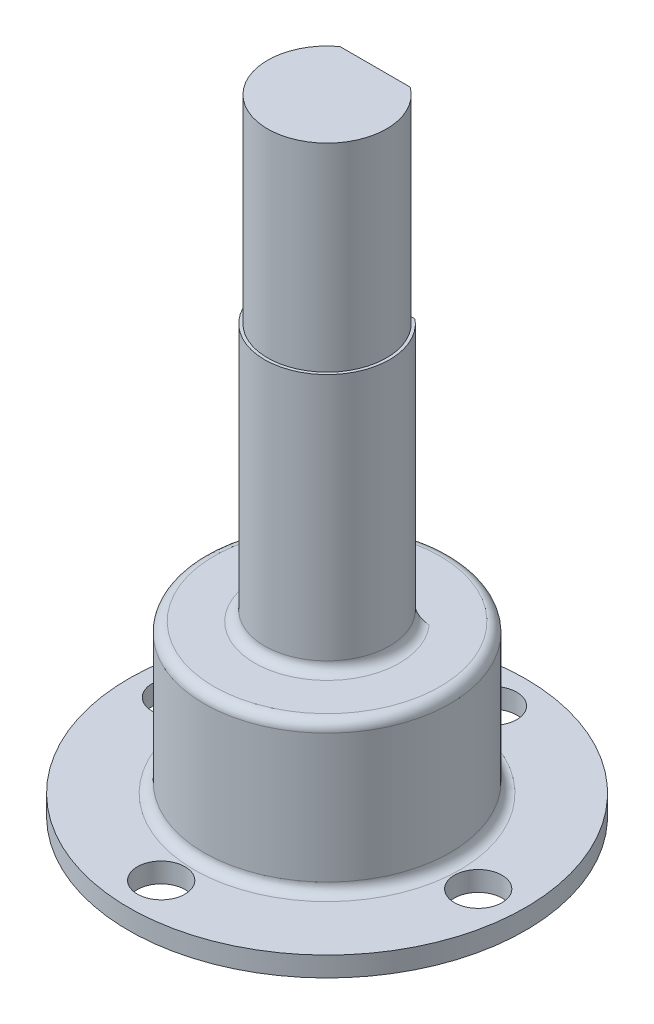
ISO-10303-21;
HEADER;
FILE_DESCRIPTION(('STEP AP214'),'2;1');
FILE_NAME('part.step','',(''),(''),'','','');
FILE_SCHEMA(('AUTOMOTIVE_DESIGN { 1 0 10303 214 1 1 1 1 }'));
ENDSEC;
DATA;
#1=APPLICATION_CONTEXT('core data for automotive mechanical design processes');
#2=APPLICATION_PROTOCOL_DEFINITION('international standard','automotive_design',2000,#1);
#3=PRODUCT_CONTEXT('',#1,'mechanical');
#4=PRODUCT('Part','Part','',(#3));
#5=PRODUCT_RELATED_PRODUCT_CATEGORY('part','',(#4));
#6=PRODUCT_DEFINITION_FORMATION('','',#4);
#7=PRODUCT_DEFINITION_CONTEXT('part definition',#1,'design');
#8=PRODUCT_DEFINITION('design','',#6,#7);
#9=PRODUCT_DEFINITION_SHAPE('','',#8);
#10=(LENGTH_UNIT() NAMED_UNIT(*) SI_UNIT(.MILLI.,.METRE.));
#11=(NAMED_UNIT(*) PLANE_ANGLE_UNIT() SI_UNIT($,.RADIAN.));
#12=(NAMED_UNIT(*) SI_UNIT($,.STERADIAN.) SOLID_ANGLE_UNIT());
#13=UNCERTAINTY_MEASURE_WITH_UNIT(LENGTH_MEASURE(1.E-05),#10,'distance_accuracy_value','');
#14=(GEOMETRIC_REPRESENTATION_CONTEXT(3) GLOBAL_UNCERTAINTY_ASSIGNED_CONTEXT((#13)) GLOBAL_UNIT_ASSIGNED_CONTEXT((#10,
#11,#12)) REPRESENTATION_CONTEXT('',''));
#15=CARTESIAN_POINT('',(0.,0.,0.));
#16=DIRECTION('',(0.,0.,1.));
#17=DIRECTION('',(1.,0.,0.));
#18=AXIS2_PLACEMENT_3D('',#15,#16,#17);
#19=CARTESIAN_POINT('',(0.,31.5,0.));
#20=DIRECTION('',(0.,1.,0.));
#21=DIRECTION('',(0.,0.,1.));
#22=AXIS2_PLACEMENT_3D('',#19,#20,#21);
#23=PLANE('',#22);
#24=DIRECTION('',(1.,0.,0.));
#25=VECTOR('',#24,1.);
#26=CARTESIAN_POINT('',(-3.64134224162171,31.5,-2.42190413345966));
#27=LINE('',#26,#25);
#28=CARTESIAN_POINT('',(-1.7704181337557,31.5,-2.42190413345966));
#29=VERTEX_POINT('',#28);
#30=CARTESIAN_POINT('',(1.7704181337557,31.5,-2.42190413345966));
#31=VERTEX_POINT('',#30);
#32=EDGE_CURVE('E94',#29,#31,#27,.T.);
#33=ORIENTED_EDGE('',*,*,#32,.F.);
#34=CARTESIAN_POINT('',(0.,31.5,0.));
#35=DIRECTION('',(0.,-1.,0.));
#36=DIRECTION('',(0.,0.,-1.));
#37=AXIS2_PLACEMENT_3D('',#34,#35,#36);
#38=CIRCLE('',#37,3.);
#39=EDGE_CURVE('E107',#31,#29,#38,.T.);
#40=ORIENTED_EDGE('',*,*,#39,.F.);
#41=EDGE_LOOP('',(#33,#40));
#42=FACE_BOUND('',#41,.T.);
#43=ADVANCED_FACE('F39',(#42),#23,.T.);
#44=CARTESIAN_POINT('',(0.,5.,0.));
#45=DIRECTION('',(0.,-1.,0.));
#46=DIRECTION('',(0.,0.,-1.));
#47=AXIS2_PLACEMENT_3D('',#44,#45,#46);
#48=CYLINDRICAL_SURFACE('',#47,3.);
#49=DIRECTION('',(0.,-1.,0.));
#50=VECTOR('',#49,1.);
#51=CARTESIAN_POINT('',(-1.7704181337557,5.,-2.42190413345966));
#52=LINE('',#51,#50);
#53=CARTESIAN_POINT('',(-1.77041813375571,21.5,-2.42190413345966));
#54=VERTEX_POINT('',#53);
#55=EDGE_CURVE('E91',#54,#29,#52,.F.);
#56=ORIENTED_EDGE('',*,*,#55,.F.);
#57=CARTESIAN_POINT('',(0.,21.5,0.));
#58=DIRECTION('',(0.,-1.,0.));
#59=DIRECTION('',(0.,0.,-1.));
#60=AXIS2_PLACEMENT_3D('',#57,#58,#59);
#61=CIRCLE('',#60,3.00000000000001);
#62=CARTESIAN_POINT('',(1.77041813375571,21.5,-2.42190413345966));
#63=VERTEX_POINT('',#62);
#64=EDGE_CURVE('E116',#63,#54,#61,.T.);
#65=ORIENTED_EDGE('',*,*,#64,.F.);
#66=DIRECTION('',(0.,-1.,0.));
#67=VECTOR('',#66,1.);
#68=CARTESIAN_POINT('',(1.7704181337557,5.,-2.42190413345966));
#69=LINE('',#68,#67);
#70=EDGE_CURVE('E113',#31,#63,#69,.T.);
#71=ORIENTED_EDGE('',*,*,#70,.F.);
#72=ORIENTED_EDGE('',*,*,#39,.T.);
#73=EDGE_LOOP('',(#56,#65,#71,#72));
#74=FACE_BOUND('',#73,.T.);
#75=ADVANCED_FACE('F112',(#74),#48,.T.);
#76=CARTESIAN_POINT('',(3.15,21.5,0.));
#77=DIRECTION('',(0.,1.,0.));
#78=DIRECTION('',(0.,0.,1.));
#79=AXIS2_PLACEMENT_3D('',#76,#77,#78);
#80=PLANE('',#79);
#81=DIRECTION('',(1.,0.,0.));
#82=VECTOR('',#81,1.);
#83=CARTESIAN_POINT('',(3.15,21.5,-2.42190413345966));
#84=LINE('',#83,#82);
#85=CARTESIAN_POINT('',(-2.01416989559744,21.5,-2.42190413345966));
#86=VERTEX_POINT('',#85);
#87=EDGE_CURVE('E97',#86,#54,#84,.T.);
#88=ORIENTED_EDGE('',*,*,#87,.F.);
#89=CARTESIAN_POINT('',(0.,21.5,0.));
#90=DIRECTION('',(0.,-1.,0.));
#91=DIRECTION('',(0.,0.,-1.));
#92=AXIS2_PLACEMENT_3D('',#89,#90,#91);
#93=CIRCLE('',#92,3.15);
#94=CARTESIAN_POINT('',(2.01416989559744,21.5,-2.42190413345966));
#95=VERTEX_POINT('',#94);
#96=EDGE_CURVE('E123',#95,#86,#93,.T.);
#97=ORIENTED_EDGE('',*,*,#96,.F.);
#98=EDGE_CURVE('E236',#63,#95,#84,.T.);
#99=ORIENTED_EDGE('',*,*,#98,.F.);
#100=ORIENTED_EDGE('',*,*,#64,.T.);
#101=EDGE_LOOP('',(#88,#97,#99,#100));
#102=FACE_BOUND('',#101,.T.);
#103=ADVANCED_FACE('F172',(#102),#80,.T.);
#104=CARTESIAN_POINT('',(0.,5.,0.));
#105=DIRECTION('',(0.,-1.,0.));
#106=DIRECTION('',(0.,0.,-1.));
#107=AXIS2_PLACEMENT_3D('',#104,#105,#106);
#108=CYLINDRICAL_SURFACE('',#107,3.15);
#109=DIRECTION('',(0.,-1.,0.));
#110=VECTOR('',#109,1.);
#111=CARTESIAN_POINT('',(-2.01416989559744,5.,-2.42190413345966));
#112=LINE('',#111,#110);
#113=CARTESIAN_POINT('',(-2.01416989559744,9.,-2.42190413345966));
#114=VERTEX_POINT('',#113);
#115=EDGE_CURVE('E233',#114,#86,#112,.F.);
#116=ORIENTED_EDGE('',*,*,#115,.F.);
#117=CARTESIAN_POINT('',(0.,9.,0.));
#118=DIRECTION('',(0.,1.,0.));
#119=DIRECTION('',(0.,0.,1.));
#120=AXIS2_PLACEMENT_3D('',#117,#118,#119);
#121=CIRCLE('',#120,3.15);
#122=CARTESIAN_POINT('',(2.01416989559744,9.,-2.42190413345966));
#123=VERTEX_POINT('',#122);
#124=EDGE_CURVE('E61',#114,#123,#121,.T.);
#125=ORIENTED_EDGE('',*,*,#124,.T.);
#126=DIRECTION('',(0.,-1.,0.));
#127=VECTOR('',#126,1.);
#128=CARTESIAN_POINT('',(2.01416989559744,5.,-2.42190413345966));
#129=LINE('',#128,#127);
#130=EDGE_CURVE('E234',#95,#123,#129,.T.);
#131=ORIENTED_EDGE('',*,*,#130,.F.);
#132=ORIENTED_EDGE('',*,*,#96,.T.);
#133=EDGE_LOOP('',(#116,#125,#131,#132));
#134=FACE_BOUND('',#133,.T.);
#135=ADVANCED_FACE('F176',(#134),#108,.T.);
#136=CARTESIAN_POINT('',(3.15,8.5,0.));
#137=DIRECTION('',(0.,1.,0.));
#138=DIRECTION('',(0.,0.,1.));
#139=AXIS2_PLACEMENT_3D('',#136,#137,#138);
#140=PLANE('',#139);
#141=CARTESIAN_POINT('',(0.,8.5,0.));
#142=DIRECTION('',(0.,1.,0.));
#143=DIRECTION('',(0.,0.,1.));
#144=AXIS2_PLACEMENT_3D('',#141,#142,#143);
#145=CIRCLE('',#144,5.7);
#146=CARTESIAN_POINT('',(0.,8.5,5.7));
#147=VERTEX_POINT('',#146);
#148=EDGE_CURVE('E115',#147,#147,#145,.T.);
#149=ORIENTED_EDGE('',*,*,#148,.T.);
#150=EDGE_LOOP('',(#149));
#151=FACE_BOUND('',#150,.T.);
#152=CARTESIAN_POINT('',(0.,8.5,0.));
#153=DIRECTION('',(0.,1.,0.));
#154=DIRECTION('',(0.,0.,1.));
#155=AXIS2_PLACEMENT_3D('',#152,#153,#154);
#156=CIRCLE('',#155,3.65);
#157=CARTESIAN_POINT('',(2.73072890787991,8.5,-2.42190413345966));
#158=VERTEX_POINT('',#157);
#159=CARTESIAN_POINT('',(-2.73072890787991,8.5,-2.42190413345966));
#160=VERTEX_POINT('',#159);
#161=EDGE_CURVE('E121',#158,#160,#156,.F.);
#162=ORIENTED_EDGE('',*,*,#161,.T.);
#163=DIRECTION('',(-1.,0.,0.));
#164=VECTOR('',#163,1.);
#165=CARTESIAN_POINT('',(-3.64134224162171,8.5,-2.42190413345966));
#166=LINE('',#165,#164);
#167=EDGE_CURVE('E109',#158,#160,#166,.T.);
#168=ORIENTED_EDGE('',*,*,#167,.F.);
#169=EDGE_LOOP('',(#162,#168));
#170=FACE_BOUND('',#169,.T.);
#171=ADVANCED_FACE('F182',(#151,#170),#140,.T.);
#172=CARTESIAN_POINT('',(0.,5.,0.));
#173=DIRECTION('',(0.,-1.,0.));
#174=DIRECTION('',(0.,0.,-1.));
#175=AXIS2_PLACEMENT_3D('',#172,#173,#174);
#176=CYLINDRICAL_SURFACE('',#175,6.2);
#177=CARTESIAN_POINT('',(0.,8.,0.));
#178=DIRECTION('',(0.,1.,0.));
#179=DIRECTION('',(0.,0.,1.));
#180=AXIS2_PLACEMENT_3D('',#177,#178,#179);
#181=CIRCLE('',#180,6.2);
#182=CARTESIAN_POINT('',(0.,8.,6.2));
#183=VERTEX_POINT('',#182);
#184=EDGE_CURVE('E136',#183,#183,#181,.F.);
#185=ORIENTED_EDGE('',*,*,#184,.T.);
#186=EDGE_LOOP('',(#185));
#187=FACE_BOUND('',#186,.T.);
#188=CARTESIAN_POINT('',(0.,1.5,0.));
#189=DIRECTION('',(0.,1.,0.));
#190=DIRECTION('',(0.,0.,1.));
#191=AXIS2_PLACEMENT_3D('',#188,#189,#190);
#192=CIRCLE('',#191,6.2);
#193=CARTESIAN_POINT('',(0.,1.5,6.2));
#194=VERTEX_POINT('',#193);
#195=EDGE_CURVE('E132',#194,#194,#192,.T.);
#196=ORIENTED_EDGE('',*,*,#195,.T.);
#197=EDGE_LOOP('',(#196));
#198=FACE_BOUND('',#197,.T.);
#199=ADVANCED_FACE('F185',(#187,#198),#176,.T.);
#200=CARTESIAN_POINT('',(6.2,1.,0.));
#201=DIRECTION('',(0.,1.,0.));
#202=DIRECTION('',(0.,0.,1.));
#203=AXIS2_PLACEMENT_3D('',#200,#201,#202);
#204=PLANE('',#203);
#205=CARTESIAN_POINT('',(0.,1.,0.));
#206=DIRECTION('',(0.,1.,0.));
#207=DIRECTION('',(0.,0.,1.));
#208=AXIS2_PLACEMENT_3D('',#205,#206,#207);
#209=CIRCLE('',#208,6.7);
#210=CARTESIAN_POINT('',(0.,1.,6.7));
#211=VERTEX_POINT('',#210);
#212=EDGE_CURVE('E140',#211,#211,#209,.F.);
#213=ORIENTED_EDGE('',*,*,#212,.T.);
#214=EDGE_LOOP('',(#213));
#215=FACE_BOUND('',#214,.T.);
#216=CARTESIAN_POINT('',(-7.99137872735473,1.,-0.371303159133185));
#217=DIRECTION('',(0.,1.,0.));
#218=DIRECTION('',(0.,0.,1.));
#219=AXIS2_PLACEMENT_3D('',#216,#217,#218);
#220=CIRCLE('',#219,1.2);
#221=CARTESIAN_POINT('',(-7.99137872735473,1.,0.828696840866815));
#222=VERTEX_POINT('',#221);
#223=EDGE_CURVE('E276',#222,#222,#220,.T.);
#224=ORIENTED_EDGE('',*,*,#223,.F.);
#225=EDGE_LOOP('',(#224));
#226=FACE_BOUND('',#225,.T.);
#227=CARTESIAN_POINT('',(-0.371303159133101,1.,7.99137872735473));
#228=DIRECTION('',(0.,1.,0.));
#229=DIRECTION('',(0.,0.,1.));
#230=AXIS2_PLACEMENT_3D('',#227,#228,#229);
#231=CIRCLE('',#230,1.2);
#232=CARTESIAN_POINT('',(-0.371303159133101,1.,9.19137872735473));
#233=VERTEX_POINT('',#232);
#234=EDGE_CURVE('E268',#233,#233,#231,.T.);
#235=ORIENTED_EDGE('',*,*,#234,.F.);
#236=EDGE_LOOP('',(#235));
#237=FACE_BOUND('',#236,.T.);
#238=CARTESIAN_POINT('',(7.99137872735473,1.,0.371303159133129));
#239=DIRECTION('',(0.,1.,0.));
#240=DIRECTION('',(0.,0.,1.));
#241=AXIS2_PLACEMENT_3D('',#238,#239,#240);
#242=CIRCLE('',#241,1.2);
#243=CARTESIAN_POINT('',(7.99137872735473,1.,1.57130315913313));
#244=VERTEX_POINT('',#243);
#245=EDGE_CURVE('E260',#244,#244,#242,.T.);
#246=ORIENTED_EDGE('',*,*,#245,.F.);
#247=EDGE_LOOP('',(#246));
#248=FACE_BOUND('',#247,.T.);
#249=CARTESIAN_POINT('',(0.371303159133101,1.,-7.99137872735473));
#250=DIRECTION('',(0.,1.,0.));
#251=DIRECTION('',(0.,0.,1.));
#252=AXIS2_PLACEMENT_3D('',#249,#250,#251);
#253=CIRCLE('',#252,1.2);
#254=CARTESIAN_POINT('',(0.371303159133101,1.,-6.79137872735473));
#255=VERTEX_POINT('',#254);
#256=EDGE_CURVE('E252',#255,#255,#253,.T.);
#257=ORIENTED_EDGE('',*,*,#256,.F.);
#258=EDGE_LOOP('',(#257));
#259=FACE_BOUND('',#258,.T.);
#260=CARTESIAN_POINT('',(0.,1.,0.));
#261=DIRECTION('',(0.,-1.,0.));
#262=DIRECTION('',(0.,0.,-1.));
#263=AXIS2_PLACEMENT_3D('',#260,#261,#262);
#264=CIRCLE('',#263,10.);
#265=CARTESIAN_POINT('',(0.,1.,-10.));
#266=VERTEX_POINT('',#265);
#267=EDGE_CURVE('E227',#266,#266,#264,.T.);
#268=ORIENTED_EDGE('',*,*,#267,.F.);
#269=EDGE_LOOP('',(#268));
#270=FACE_BOUND('',#269,.T.);
#271=ADVANCED_FACE('F189',(#215,#226,#237,#248,#259,#270),#204,.T.);
#272=CARTESIAN_POINT('',(0.,5.,0.));
#273=DIRECTION('',(0.,-1.,0.));
#274=DIRECTION('',(0.,0.,-1.));
#275=AXIS2_PLACEMENT_3D('',#272,#273,#274);
#276=CYLINDRICAL_SURFACE('',#275,10.);
#277=ORIENTED_EDGE('',*,*,#267,.T.);
#278=EDGE_LOOP('',(#277));
#279=FACE_BOUND('',#278,.T.);
#280=CARTESIAN_POINT('',(0.,0.,0.));
#281=DIRECTION('',(0.,-1.,0.));
#282=DIRECTION('',(0.,0.,-1.));
#283=AXIS2_PLACEMENT_3D('',#280,#281,#282);
#284=CIRCLE('',#283,10.);
#285=CARTESIAN_POINT('',(0.,0.,-10.));
#286=VERTEX_POINT('',#285);
#287=EDGE_CURVE('E220',#286,#286,#284,.T.);
#288=ORIENTED_EDGE('',*,*,#287,.F.);
#289=EDGE_LOOP('',(#288));
#290=FACE_BOUND('',#289,.T.);
#291=ADVANCED_FACE('F193',(#279,#290),#276,.T.);
#292=CARTESIAN_POINT('',(10.,0.,0.));
#293=DIRECTION('',(0.,-1.,0.));
#294=DIRECTION('',(0.,0.,-1.));
#295=AXIS2_PLACEMENT_3D('',#292,#293,#294);
#296=PLANE('',#295);
#297=CARTESIAN_POINT('',(-7.99137872735473,0.,-0.371303159133185));
#298=DIRECTION('',(0.,-1.,0.));
#299=DIRECTION('',(0.,0.,-1.));
#300=AXIS2_PLACEMENT_3D('',#297,#298,#299);
#301=CIRCLE('',#300,1.2);
#302=CARTESIAN_POINT('',(-7.99137872735473,0.,-1.57130315913318));
#303=VERTEX_POINT('',#302);
#304=EDGE_CURVE('E272',#303,#303,#301,.T.);
#305=ORIENTED_EDGE('',*,*,#304,.F.);
#306=EDGE_LOOP('',(#305));
#307=FACE_BOUND('',#306,.T.);
#308=CARTESIAN_POINT('',(-0.371303159133101,0.,7.99137872735473));
#309=DIRECTION('',(0.,-1.,0.));
#310=DIRECTION('',(0.,0.,-1.));
#311=AXIS2_PLACEMENT_3D('',#308,#309,#310);
#312=CIRCLE('',#311,1.2);
#313=CARTESIAN_POINT('',(-0.371303159133101,0.,6.79137872735473));
#314=VERTEX_POINT('',#313);
#315=EDGE_CURVE('E264',#314,#314,#312,.T.);
#316=ORIENTED_EDGE('',*,*,#315,.F.);
#317=EDGE_LOOP('',(#316));
#318=FACE_BOUND('',#317,.T.);
#319=CARTESIAN_POINT('',(7.99137872735473,0.,0.371303159133129));
#320=DIRECTION('',(0.,-1.,0.));
#321=DIRECTION('',(0.,0.,-1.));
#322=AXIS2_PLACEMENT_3D('',#319,#320,#321);
#323=CIRCLE('',#322,1.2);
#324=CARTESIAN_POINT('',(7.99137872735473,0.,-0.82869684086687));
#325=VERTEX_POINT('',#324);
#326=EDGE_CURVE('E256',#325,#325,#323,.T.);
#327=ORIENTED_EDGE('',*,*,#326,.F.);
#328=EDGE_LOOP('',(#327));
#329=FACE_BOUND('',#328,.T.);
#330=CARTESIAN_POINT('',(0.371303159133101,0.,-7.99137872735473));
#331=DIRECTION('',(0.,-1.,0.));
#332=DIRECTION('',(0.,0.,-1.));
#333=AXIS2_PLACEMENT_3D('',#330,#331,#332);
#334=CIRCLE('',#333,1.2);
#335=CARTESIAN_POINT('',(0.371303159133101,0.,-9.19137872735473));
#336=VERTEX_POINT('',#335);
#337=EDGE_CURVE('E110',#336,#336,#334,.T.);
#338=ORIENTED_EDGE('',*,*,#337,.F.);
#339=EDGE_LOOP('',(#338));
#340=FACE_BOUND('',#339,.T.);
#341=ORIENTED_EDGE('',*,*,#287,.T.);
#342=EDGE_LOOP('',(#341));
#343=FACE_BOUND('',#342,.T.);
#344=CARTESIAN_POINT('',(0.,0.,0.));
#345=DIRECTION('',(0.,-1.,0.));
#346=DIRECTION('',(0.,0.,-1.));
#347=AXIS2_PLACEMENT_3D('',#344,#345,#346);
#348=CIRCLE('',#347,4.5);
#349=CARTESIAN_POINT('',(0.,0.,-4.5));
#350=VERTEX_POINT('',#349);
#351=EDGE_CURVE('E216',#350,#350,#348,.T.);
#352=ORIENTED_EDGE('',*,*,#351,.F.);
#353=EDGE_LOOP('',(#352));
#354=FACE_BOUND('',#353,.T.);
#355=ADVANCED_FACE('F197',(#307,#318,#329,#340,#343,#354),#296,.T.);
#356=CARTESIAN_POINT('',(0.,5.,0.));
#357=DIRECTION('',(0.,-1.,0.));
#358=DIRECTION('',(0.,0.,-1.));
#359=AXIS2_PLACEMENT_3D('',#356,#357,#358);
#360=CYLINDRICAL_SURFACE('',#359,4.5);
#361=ORIENTED_EDGE('',*,*,#351,.T.);
#362=EDGE_LOOP('',(#361));
#363=FACE_BOUND('',#362,.T.);
#364=CARTESIAN_POINT('',(0.,5.,0.));
#365=DIRECTION('',(0.,-1.,0.));
#366=DIRECTION('',(0.,0.,-1.));
#367=AXIS2_PLACEMENT_3D('',#364,#365,#366);
#368=CIRCLE('',#367,4.5);
#369=CARTESIAN_POINT('',(0.,5.,-4.5));
#370=VERTEX_POINT('',#369);
#371=EDGE_CURVE('E103',#370,#370,#368,.T.);
#372=ORIENTED_EDGE('',*,*,#371,.F.);
#373=EDGE_LOOP('',(#372));
#374=FACE_BOUND('',#373,.T.);
#375=ADVANCED_FACE('F201',(#363,#374),#360,.F.);
#376=CARTESIAN_POINT('',(4.5,5.,0.));
#377=DIRECTION('',(0.,-1.,0.));
#378=DIRECTION('',(0.,0.,-1.));
#379=AXIS2_PLACEMENT_3D('',#376,#377,#378);
#380=PLANE('',#379);
#381=ORIENTED_EDGE('',*,*,#371,.T.);
#382=EDGE_LOOP('',(#381));
#383=FACE_BOUND('',#382,.T.);
#384=ADVANCED_FACE('F204',(#383),#380,.T.);
#385=CARTESIAN_POINT('',(-3.64134224162171,1.7776982286854,-2.42190413345966));
#386=DIRECTION('',(0.,0.,1.));
#387=DIRECTION('',(1.,0.,0.));
#388=AXIS2_PLACEMENT_3D('',#385,#386,#387);
#389=PLANE('',#388);
#390=ORIENTED_EDGE('',*,*,#55,.T.);
#391=ORIENTED_EDGE('',*,*,#32,.T.);
#392=ORIENTED_EDGE('',*,*,#70,.T.);
#393=ORIENTED_EDGE('',*,*,#98,.T.);
#394=ORIENTED_EDGE('',*,*,#130,.T.);
#395=CARTESIAN_POINT('',(2.01416989559744,9.,-2.42190413345966));
#396=CARTESIAN_POINT('',(2.01410251492904,8.97836536570635,-2.42190413345966));
#397=CARTESIAN_POINT('',(2.01636181038486,8.95681778662002,-2.42190413345966));
#398=CARTESIAN_POINT('',(2.02490984326628,8.91478724598333,-2.42190413345966));
#399=CARTESIAN_POINT('',(2.03115091115904,8.89429474849456,-2.42190413345966));
#400=CARTESIAN_POINT('',(2.04702757630945,8.85481779019472,-2.42190413345966));
#401=CARTESIAN_POINT('',(2.05664738323025,8.83582680943459,-2.42190413345966));
#402=CARTESIAN_POINT('',(2.07860147607339,8.79943433222572,-2.42190413345966));
#403=CARTESIAN_POINT('',(2.09094446794697,8.78203819283065,-2.42190413345966));
#404=CARTESIAN_POINT('',(2.12504561313686,8.73991431343108,-2.42190413345966));
#405=CARTESIAN_POINT('',(2.14826423824995,8.71637120283324,-2.42190413345966));
#406=CARTESIAN_POINT('',(2.19807954578482,8.67319553587424,-2.42190413345966));
#407=CARTESIAN_POINT('',(2.22468391532608,8.65357214798914,-2.42190413345966));
#408=CARTESIAN_POINT('',(2.29197143448726,8.61047003148581,-2.42190413345966));
#409=CARTESIAN_POINT('',(2.33385433334388,8.58886454486127,-2.42190413345966));
#410=CARTESIAN_POINT('',(2.42049947655846,8.55261526163959,-2.42190413345966));
#411=CARTESIAN_POINT('',(2.46526378422213,8.5379765181534,-2.42190413345966));
#412=CARTESIAN_POINT('',(2.54687820951526,8.5179366821242,-2.42190413345966));
#413=CARTESIAN_POINT('',(2.58341582475566,8.51124114471195,-2.42190413345966));
#414=CARTESIAN_POINT('',(2.65687358803554,8.50229131847252,-2.42190413345966));
#415=CARTESIAN_POINT('',(2.69379148020802,8.50001846459261,-2.42190413345966));
#416=CARTESIAN_POINT('',(2.73072890787991,8.5,-2.42190413345966));
#417=B_SPLINE_CURVE_WITH_KNOTS('',3,(#395,#396,#397,#398,#399,#400,#401,#402,#403,#404,#405,
#406,#407,#408,#409,#410,#411,#412,#413,#414,#415,#416),.UNSPECIFIED.,.F.,.F.,(4,2,2,2,2,2,2,2,
2,2,4),(0.,0.0646484168161605,0.128537030004227,0.192130951588462,0.255931205802625,
0.354575234680532,0.453447363614599,0.594086953761747,0.734828397587736,0.84600927384569,
0.956722431852321),.UNSPECIFIED.);
#418=EDGE_CURVE('E11',#123,#158,#417,.T.);
#419=ORIENTED_EDGE('',*,*,#418,.T.);
#420=ORIENTED_EDGE('',*,*,#167,.T.);
#421=CARTESIAN_POINT('',(-2.73072890787991,8.5,-2.42190413345966));
#422=CARTESIAN_POINT('',(-2.70488033474315,8.50000519389752,-2.42190413345966));
#423=CARTESIAN_POINT('',(-2.6790514739832,8.50112171072178,-2.42190413345966));
#424=CARTESIAN_POINT('',(-2.62757171281522,8.50552486168542,-2.42190413345966));
#425=CARTESIAN_POINT('',(-2.60192086293555,8.50881208841135,-2.42190413345966));
#426=CARTESIAN_POINT('',(-2.52512820183031,8.52190740454944,-2.42190413345966));
#427=CARTESIAN_POINT('',(-2.4744913089387,8.53494785050639,-2.42190413345966));
#428=CARTESIAN_POINT('',(-2.38492020987793,8.5664324779675,-2.42190413345966));
#429=CARTESIAN_POINT('',(-2.34549871738448,8.58351538972083,-2.42190413345966));
#430=CARTESIAN_POINT('',(-2.26985033077688,8.62363332665786,-2.42190413345966));
#431=CARTESIAN_POINT('',(-2.23361421500322,8.64665035678255,-2.42190413345966));
#432=CARTESIAN_POINT('',(-2.17793561238694,8.68992899005655,-2.42190413345966));
#433=CARTESIAN_POINT('',(-2.15705210107936,8.70833880323115,-2.42190413345966));
#434=CARTESIAN_POINT('',(-2.11819764091185,8.74804109043111,-2.42190413345966));
#435=CARTESIAN_POINT('',(-2.10022331697794,8.76933017066612,-2.42190413345966));
#436=CARTESIAN_POINT('',(-2.07200031980793,8.80958914418465,-2.42190413345966));
#437=CARTESIAN_POINT('',(-2.06092492494651,8.82797577028556,-2.42190413345966));
#438=CARTESIAN_POINT('',(-2.04190375158941,8.86627483571122,-2.42190413345966));
#439=CARTESIAN_POINT('',(-2.03394865525568,8.8861825168023,-2.42190413345966));
#440=CARTESIAN_POINT('',(-2.02342525080204,8.92174208920338,-2.42190413345966));
#441=CARTESIAN_POINT('',(-2.01999085895195,8.93713829679148,-2.42190413345966));
#442=CARTESIAN_POINT('',(-2.01534626515479,8.96834686585239,-2.42190413345966));
#443=CARTESIAN_POINT('',(-2.01414850529248,8.98416106187478,-2.42190413345966));
#444=CARTESIAN_POINT('',(-2.01416989559749,9.00000000000002,-2.42190413345966));
#445=B_SPLINE_CURVE_WITH_KNOTS('',3,(#421,#422,#423,#424,#425,#426,#427,#428,#429,#430,#431,
#432,#433,#434,#435,#436,#437,#438,#439,#440,#441,#442,#443,#444),.UNSPECIFIED.,.F.,.F.,(4,2,2,
2,2,2,2,2,2,2,2,4),(0.,0.0774850868345579,0.154991335232288,0.311026500897649,0.439501641903988,
0.567591676363427,0.650882788434769,0.734076567310733,0.798242047457127,0.862214430631374,
0.909383074076125,0.956813337588575),.UNSPECIFIED.);
#446=EDGE_CURVE('E54',#160,#114,#445,.T.);
#447=ORIENTED_EDGE('',*,*,#446,.T.);
#448=ORIENTED_EDGE('',*,*,#115,.T.);
#449=ORIENTED_EDGE('',*,*,#87,.T.);
#450=EDGE_LOOP('',(#390,#391,#392,#393,#394,#419,#420,#447,#448,#449));
#451=FACE_BOUND('',#450,.T.);
#452=ADVANCED_FACE('F93',(#451),#389,.F.);
#453=CARTESIAN_POINT('',(0.371303159133101,1.,-7.99137872735473));
#454=DIRECTION('',(0.,1.,0.));
#455=DIRECTION('',(0.,0.,1.));
#456=AXIS2_PLACEMENT_3D('',#453,#454,#455);
#457=CYLINDRICAL_SURFACE('',#456,1.2);
#458=ORIENTED_EDGE('',*,*,#256,.T.);
#459=EDGE_LOOP('',(#458));
#460=FACE_BOUND('',#459,.T.);
#461=ORIENTED_EDGE('',*,*,#337,.T.);
#462=EDGE_LOOP('',(#461));
#463=FACE_BOUND('',#462,.T.);
#464=ADVANCED_FACE('F211',(#460,#463),#457,.F.);
#465=CARTESIAN_POINT('',(7.99137872735473,1.,0.371303159133129));
#466=DIRECTION('',(0.,1.,0.));
#467=DIRECTION('',(0.,0.,1.));
#468=AXIS2_PLACEMENT_3D('',#465,#466,#467);
#469=CYLINDRICAL_SURFACE('',#468,1.2);
#470=ORIENTED_EDGE('',*,*,#245,.T.);
#471=EDGE_LOOP('',(#470));
#472=FACE_BOUND('',#471,.T.);
#473=ORIENTED_EDGE('',*,*,#326,.T.);
#474=EDGE_LOOP('',(#473));
#475=FACE_BOUND('',#474,.T.);
#476=ADVANCED_FACE('F299',(#472,#475),#469,.F.);
#477=CARTESIAN_POINT('',(-0.371303159133101,1.,7.99137872735473));
#478=DIRECTION('',(0.,1.,0.));
#479=DIRECTION('',(0.,0.,1.));
#480=AXIS2_PLACEMENT_3D('',#477,#478,#479);
#481=CYLINDRICAL_SURFACE('',#480,1.2);
#482=ORIENTED_EDGE('',*,*,#234,.T.);
#483=EDGE_LOOP('',(#482));
#484=FACE_BOUND('',#483,.T.);
#485=ORIENTED_EDGE('',*,*,#315,.T.);
#486=EDGE_LOOP('',(#485));
#487=FACE_BOUND('',#486,.T.);
#488=ADVANCED_FACE('F305',(#484,#487),#481,.F.);
#489=CARTESIAN_POINT('',(-7.99137872735473,1.,-0.371303159133185));
#490=DIRECTION('',(0.,1.,0.));
#491=DIRECTION('',(0.,0.,1.));
#492=AXIS2_PLACEMENT_3D('',#489,#490,#491);
#493=CYLINDRICAL_SURFACE('',#492,1.2);
#494=ORIENTED_EDGE('',*,*,#223,.T.);
#495=EDGE_LOOP('',(#494));
#496=FACE_BOUND('',#495,.T.);
#497=ORIENTED_EDGE('',*,*,#304,.T.);
#498=EDGE_LOOP('',(#497));
#499=FACE_BOUND('',#498,.T.);
#500=ADVANCED_FACE('F156',(#496,#499),#493,.F.);
#501=CARTESIAN_POINT('',(0.,9.,0.));
#502=DIRECTION('',(0.,1.,0.));
#503=DIRECTION('',(0.,0.,1.));
#504=AXIS2_PLACEMENT_3D('',#501,#502,#503);
#505=TOROIDAL_SURFACE('',#504,3.65,0.5);
#506=ORIENTED_EDGE('',*,*,#418,.F.);
#507=ORIENTED_EDGE('',*,*,#124,.F.);
#508=ORIENTED_EDGE('',*,*,#446,.F.);
#509=ORIENTED_EDGE('',*,*,#161,.F.);
#510=EDGE_LOOP('',(#506,#507,#508,#509));
#511=FACE_BOUND('',#510,.T.);
#512=ADVANCED_FACE('F151',(#511),#505,.F.);
#513=CARTESIAN_POINT('',(0.,8.,0.));
#514=DIRECTION('',(0.,1.,0.));
#515=DIRECTION('',(0.,0.,1.));
#516=AXIS2_PLACEMENT_3D('',#513,#514,#515);
#517=TOROIDAL_SURFACE('',#516,5.7,0.5);
#518=ORIENTED_EDGE('',*,*,#148,.F.);
#519=EDGE_LOOP('',(#518));
#520=FACE_BOUND('',#519,.T.);
#521=ORIENTED_EDGE('',*,*,#184,.F.);
#522=EDGE_LOOP('',(#521));
#523=FACE_BOUND('',#522,.T.);
#524=ADVANCED_FACE('F155',(#520,#523),#517,.T.);
#525=CARTESIAN_POINT('',(0.,1.5,0.));
#526=DIRECTION('',(0.,1.,0.));
#527=DIRECTION('',(0.,0.,1.));
#528=AXIS2_PLACEMENT_3D('',#525,#526,#527);
#529=TOROIDAL_SURFACE('',#528,6.7,0.5);
#530=ORIENTED_EDGE('',*,*,#195,.F.);
#531=EDGE_LOOP('',(#530));
#532=FACE_BOUND('',#531,.T.);
#533=ORIENTED_EDGE('',*,*,#212,.F.);
#534=EDGE_LOOP('',(#533));
#535=FACE_BOUND('',#534,.T.);
#536=ADVANCED_FACE('F41',(#532,#535),#529,.F.);
#537=CLOSED_SHELL('',(#43,#75,#103,#135,#171,#199,#271,#291,#355,#375,#384,#452,#464,#476,#488,
#500,#512,#524,#536));
#538=MANIFOLD_SOLID_BREP('B2',#537);
#539=ADVANCED_BREP_SHAPE_REPRESENTATION('',(#18,#538),#14);
#540=SHAPE_DEFINITION_REPRESENTATION(#9,#539);
ENDSEC;
END-ISO-10303-21;
